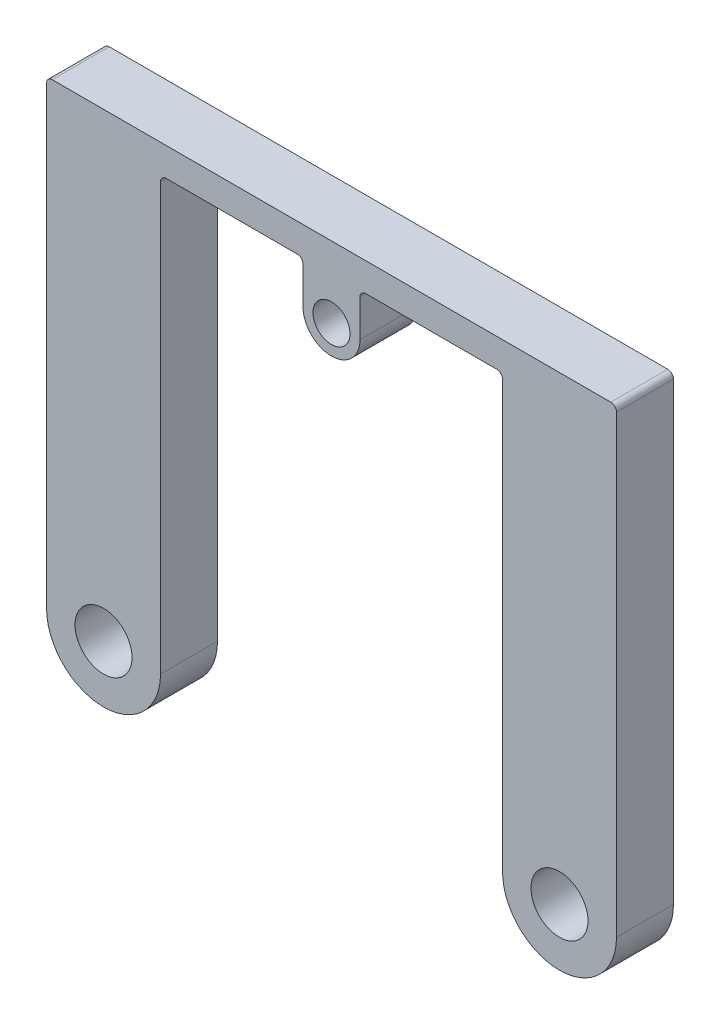
ISO-10303-21;
HEADER;
FILE_DESCRIPTION(('STEP AP214'),'2;1');
FILE_NAME('part.step','',(''),(''),'','','');
FILE_SCHEMA(('AUTOMOTIVE_DESIGN { 1 0 10303 214 1 1 1 1 }'));
ENDSEC;
DATA;
#1=APPLICATION_CONTEXT('core data for automotive mechanical design processes');
#2=APPLICATION_PROTOCOL_DEFINITION('international standard','automotive_design',2000,#1);
#3=PRODUCT_CONTEXT('',#1,'mechanical');
#4=PRODUCT('Part','Part','',(#3));
#5=PRODUCT_RELATED_PRODUCT_CATEGORY('part','',(#4));
#6=PRODUCT_DEFINITION_FORMATION('','',#4);
#7=PRODUCT_DEFINITION_CONTEXT('part definition',#1,'design');
#8=PRODUCT_DEFINITION('design','',#6,#7);
#9=PRODUCT_DEFINITION_SHAPE('','',#8);
#10=(LENGTH_UNIT() NAMED_UNIT(*) SI_UNIT(.MILLI.,.METRE.));
#11=(NAMED_UNIT(*) PLANE_ANGLE_UNIT() SI_UNIT($,.RADIAN.));
#12=(NAMED_UNIT(*) SI_UNIT($,.STERADIAN.) SOLID_ANGLE_UNIT());
#13=UNCERTAINTY_MEASURE_WITH_UNIT(LENGTH_MEASURE(1.E-05),#10,'distance_accuracy_value','');
#14=(GEOMETRIC_REPRESENTATION_CONTEXT(3) GLOBAL_UNCERTAINTY_ASSIGNED_CONTEXT((#13)) GLOBAL_UNIT_ASSIGNED_CONTEXT((#10,
#11,#12)) REPRESENTATION_CONTEXT('',''));
#15=CARTESIAN_POINT('',(0.,0.,0.));
#16=DIRECTION('',(0.,0.,1.));
#17=DIRECTION('',(1.,0.,0.));
#18=AXIS2_PLACEMENT_3D('',#15,#16,#17);
#19=CARTESIAN_POINT('',(0.,75.8172307653194,5.));
#20=DIRECTION('',(0.,1.,0.));
#21=DIRECTION('',(0.,0.,1.));
#22=AXIS2_PLACEMENT_3D('',#19,#20,#21);
#23=PLANE('',#22);
#24=DIRECTION('',(1.,0.,0.));
#25=VECTOR('',#24,1.);
#26=CARTESIAN_POINT('',(0.,75.8172307653194,5.));
#27=LINE('',#26,#25);
#28=CARTESIAN_POINT('',(-29.,75.8172307653194,5.));
#29=VERTEX_POINT('',#28);
#30=CARTESIAN_POINT('',(-6.,75.8172307653194,5.));
#31=VERTEX_POINT('',#30);
#32=EDGE_CURVE('E226',#29,#31,#27,.T.);
#33=ORIENTED_EDGE('',*,*,#32,.F.);
#34=DIRECTION('',(0.,0.,-1.));
#35=VECTOR('',#34,1.);
#36=CARTESIAN_POINT('',(-29.,75.8172307653194,5.));
#37=LINE('',#36,#35);
#38=CARTESIAN_POINT('',(-29.,75.8172307653194,-5.));
#39=VERTEX_POINT('',#38);
#40=EDGE_CURVE('E329',#29,#39,#37,.T.);
#41=ORIENTED_EDGE('',*,*,#40,.T.);
#42=DIRECTION('',(1.,0.,0.));
#43=VECTOR('',#42,1.);
#44=CARTESIAN_POINT('',(0.,75.8172307653194,-5.));
#45=LINE('',#44,#43);
#46=CARTESIAN_POINT('',(-6.,75.8172307653194,-5.));
#47=VERTEX_POINT('',#46);
#48=EDGE_CURVE('E261',#39,#47,#45,.T.);
#49=ORIENTED_EDGE('',*,*,#48,.T.);
#50=DIRECTION('',(0.,0.,1.));
#51=VECTOR('',#50,1.);
#52=CARTESIAN_POINT('',(-6.,75.8172307653194,5.));
#53=LINE('',#52,#51);
#54=EDGE_CURVE('E325',#47,#31,#53,.T.);
#55=ORIENTED_EDGE('',*,*,#54,.T.);
#56=EDGE_LOOP('',(#33,#41,#49,#55));
#57=FACE_BOUND('',#56,.T.);
#58=ADVANCED_FACE('F44',(#57),#23,.F.);
#59=CARTESIAN_POINT('',(-50.,0.,5.));
#60=DIRECTION('',(-1.,0.,0.));
#61=DIRECTION('',(0.,0.,1.));
#62=AXIS2_PLACEMENT_3D('',#59,#60,#61);
#63=PLANE('',#62);
#64=DIRECTION('',(0.,1.,0.));
#65=VECTOR('',#64,1.);
#66=CARTESIAN_POINT('',(-50.,0.,5.));
#67=LINE('',#66,#65);
#68=CARTESIAN_POINT('',(-50.,0.,5.));
#69=VERTEX_POINT('',#68);
#70=CARTESIAN_POINT('',(-50.,79.8172307653194,5.));
#71=VERTEX_POINT('',#70);
#72=EDGE_CURVE('E211',#69,#71,#67,.T.);
#73=ORIENTED_EDGE('',*,*,#72,.T.);
#74=DIRECTION('',(0.,0.,-1.));
#75=VECTOR('',#74,1.);
#76=CARTESIAN_POINT('',(-50.,79.8172307653194,5.));
#77=LINE('',#76,#75);
#78=CARTESIAN_POINT('',(-50.,79.8172307653194,-5.));
#79=VERTEX_POINT('',#78);
#80=EDGE_CURVE('E300',#71,#79,#77,.T.);
#81=ORIENTED_EDGE('',*,*,#80,.T.);
#82=DIRECTION('',(0.,1.,0.));
#83=VECTOR('',#82,1.);
#84=CARTESIAN_POINT('',(-50.,0.,-5.));
#85=LINE('',#84,#83);
#86=CARTESIAN_POINT('',(-50.,0.,-5.));
#87=VERTEX_POINT('',#86);
#88=EDGE_CURVE('E250',#87,#79,#85,.T.);
#89=ORIENTED_EDGE('',*,*,#88,.F.);
#90=DIRECTION('',(0.,0.,-1.));
#91=VECTOR('',#90,1.);
#92=CARTESIAN_POINT('',(-50.,0.,5.));
#93=LINE('',#92,#91);
#94=EDGE_CURVE('E297',#69,#87,#93,.T.);
#95=ORIENTED_EDGE('',*,*,#94,.F.);
#96=EDGE_LOOP('',(#73,#81,#89,#95));
#97=FACE_BOUND('',#96,.T.);
#98=ADVANCED_FACE('F408',(#97),#63,.T.);
#99=CARTESIAN_POINT('',(-40.,0.,5.));
#100=DIRECTION('',(0.,0.,-1.));
#101=DIRECTION('',(-1.,0.,0.));
#102=AXIS2_PLACEMENT_3D('',#99,#100,#101);
#103=CYLINDRICAL_SURFACE('',#102,10.);
#104=CARTESIAN_POINT('',(-40.,0.,-5.));
#105=DIRECTION('',(0.,0.,1.));
#106=DIRECTION('',(1.,0.,0.));
#107=AXIS2_PLACEMENT_3D('',#104,#105,#106);
#108=CIRCLE('',#107,10.);
#109=CARTESIAN_POINT('',(-30.,0.,-5.));
#110=VERTEX_POINT('',#109);
#111=EDGE_CURVE('E253',#87,#110,#108,.T.);
#112=ORIENTED_EDGE('',*,*,#111,.T.);
#113=DIRECTION('',(0.,0.,-1.));
#114=VECTOR('',#113,1.);
#115=CARTESIAN_POINT('',(-30.,0.,5.));
#116=LINE('',#115,#114);
#117=CARTESIAN_POINT('',(-30.,0.,5.));
#118=VERTEX_POINT('',#117);
#119=EDGE_CURVE('E293',#118,#110,#116,.T.);
#120=ORIENTED_EDGE('',*,*,#119,.F.);
#121=CARTESIAN_POINT('',(-40.,0.,5.));
#122=DIRECTION('',(0.,0.,1.));
#123=DIRECTION('',(1.,0.,0.));
#124=AXIS2_PLACEMENT_3D('',#121,#122,#123);
#125=CIRCLE('',#124,10.);
#126=EDGE_CURVE('E215',#69,#118,#125,.T.);
#127=ORIENTED_EDGE('',*,*,#126,.F.);
#128=ORIENTED_EDGE('',*,*,#94,.T.);
#129=EDGE_LOOP('',(#112,#120,#127,#128));
#130=FACE_BOUND('',#129,.T.);
#131=ADVANCED_FACE('F415',(#130),#103,.T.);
#132=CARTESIAN_POINT('',(-30.,0.,5.));
#133=DIRECTION('',(1.,0.,0.));
#134=DIRECTION('',(0.,0.,-1.));
#135=AXIS2_PLACEMENT_3D('',#132,#133,#134);
#136=PLANE('',#135);
#137=DIRECTION('',(0.,-1.,0.));
#138=VECTOR('',#137,1.);
#139=CARTESIAN_POINT('',(-30.,0.,-5.));
#140=LINE('',#139,#138);
#141=CARTESIAN_POINT('',(-30.,74.8172307653194,-5.));
#142=VERTEX_POINT('',#141);
#143=EDGE_CURVE('E257',#142,#110,#140,.T.);
#144=ORIENTED_EDGE('',*,*,#143,.F.);
#145=DIRECTION('',(0.,0.,-1.));
#146=VECTOR('',#145,1.);
#147=CARTESIAN_POINT('',(-30.,74.8172307653194,5.));
#148=LINE('',#147,#146);
#149=CARTESIAN_POINT('',(-30.,74.8172307653194,5.));
#150=VERTEX_POINT('',#149);
#151=EDGE_CURVE('E333',#142,#150,#148,.F.);
#152=ORIENTED_EDGE('',*,*,#151,.T.);
#153=DIRECTION('',(0.,-1.,0.));
#154=VECTOR('',#153,1.);
#155=CARTESIAN_POINT('',(-30.,0.,5.));
#156=LINE('',#155,#154);
#157=EDGE_CURVE('E220',#150,#118,#156,.T.);
#158=ORIENTED_EDGE('',*,*,#157,.T.);
#159=ORIENTED_EDGE('',*,*,#119,.T.);
#160=EDGE_LOOP('',(#144,#152,#158,#159));
#161=FACE_BOUND('',#160,.T.);
#162=ADVANCED_FACE('F418',(#161),#136,.T.);
#163=CARTESIAN_POINT('',(6.,75.8172307653194,5.));
#164=VERTEX_POINT('',#163);
#165=CARTESIAN_POINT('',(29.,75.8172307653194,5.));
#166=VERTEX_POINT('',#165);
#167=EDGE_CURVE('E223',#164,#166,#27,.T.);
#168=ORIENTED_EDGE('',*,*,#167,.F.);
#169=DIRECTION('',(0.,0.,1.));
#170=VECTOR('',#169,1.);
#171=CARTESIAN_POINT('',(6.,75.8172307653194,5.));
#172=LINE('',#171,#170);
#173=CARTESIAN_POINT('',(6.,75.8172307653194,-5.));
#174=VERTEX_POINT('',#173);
#175=EDGE_CURVE('E345',#164,#174,#172,.F.);
#176=ORIENTED_EDGE('',*,*,#175,.T.);
#177=CARTESIAN_POINT('',(29.,75.8172307653194,-5.));
#178=VERTEX_POINT('',#177);
#179=EDGE_CURVE('E260',#174,#178,#45,.T.);
#180=ORIENTED_EDGE('',*,*,#179,.T.);
#181=DIRECTION('',(0.,0.,-1.));
#182=VECTOR('',#181,1.);
#183=CARTESIAN_POINT('',(29.,75.8172307653194,5.));
#184=LINE('',#183,#182);
#185=EDGE_CURVE('E342',#178,#166,#184,.F.);
#186=ORIENTED_EDGE('',*,*,#185,.T.);
#187=EDGE_LOOP('',(#168,#176,#180,#186));
#188=FACE_BOUND('',#187,.T.);
#189=ADVANCED_FACE('F379',(#188),#23,.F.);
#190=CARTESIAN_POINT('',(30.,0.,5.));
#191=DIRECTION('',(-1.,0.,0.));
#192=DIRECTION('',(0.,0.,1.));
#193=AXIS2_PLACEMENT_3D('',#190,#191,#192);
#194=PLANE('',#193);
#195=DIRECTION('',(0.,1.,0.));
#196=VECTOR('',#195,1.);
#197=CARTESIAN_POINT('',(30.,0.,5.));
#198=LINE('',#197,#196);
#199=CARTESIAN_POINT('',(30.,0.,5.));
#200=VERTEX_POINT('',#199);
#201=CARTESIAN_POINT('',(30.,74.8172307653194,5.));
#202=VERTEX_POINT('',#201);
#203=EDGE_CURVE('E227',#200,#202,#198,.T.);
#204=ORIENTED_EDGE('',*,*,#203,.T.);
#205=DIRECTION('',(0.,0.,-1.));
#206=VECTOR('',#205,1.);
#207=CARTESIAN_POINT('',(30.,74.8172307653194,5.));
#208=LINE('',#207,#206);
#209=CARTESIAN_POINT('',(30.,74.8172307653194,-5.));
#210=VERTEX_POINT('',#209);
#211=EDGE_CURVE('E348',#202,#210,#208,.T.);
#212=ORIENTED_EDGE('',*,*,#211,.T.);
#213=DIRECTION('',(0.,1.,0.));
#214=VECTOR('',#213,1.);
#215=CARTESIAN_POINT('',(30.,0.,-5.));
#216=LINE('',#215,#214);
#217=CARTESIAN_POINT('',(30.,0.,-5.));
#218=VERTEX_POINT('',#217);
#219=EDGE_CURVE('E265',#218,#210,#216,.T.);
#220=ORIENTED_EDGE('',*,*,#219,.F.);
#221=DIRECTION('',(0.,0.,-1.));
#222=VECTOR('',#221,1.);
#223=CARTESIAN_POINT('',(30.,0.,5.));
#224=LINE('',#223,#222);
#225=EDGE_CURVE('E290',#200,#218,#224,.T.);
#226=ORIENTED_EDGE('',*,*,#225,.F.);
#227=EDGE_LOOP('',(#204,#212,#220,#226));
#228=FACE_BOUND('',#227,.T.);
#229=ADVANCED_FACE('F383',(#228),#194,.T.);
#230=CARTESIAN_POINT('',(40.,0.,5.));
#231=DIRECTION('',(0.,0.,-1.));
#232=DIRECTION('',(-1.,0.,0.));
#233=AXIS2_PLACEMENT_3D('',#230,#231,#232);
#234=CYLINDRICAL_SURFACE('',#233,10.);
#235=CARTESIAN_POINT('',(40.,0.,-5.));
#236=DIRECTION('',(0.,0.,1.));
#237=DIRECTION('',(1.,0.,0.));
#238=AXIS2_PLACEMENT_3D('',#235,#236,#237);
#239=CIRCLE('',#238,10.);
#240=CARTESIAN_POINT('',(50.,0.,-5.));
#241=VERTEX_POINT('',#240);
#242=EDGE_CURVE('E269',#241,#218,#239,.F.);
#243=ORIENTED_EDGE('',*,*,#242,.F.);
#244=DIRECTION('',(0.,0.,-1.));
#245=VECTOR('',#244,1.);
#246=CARTESIAN_POINT('',(50.,0.,5.));
#247=LINE('',#246,#245);
#248=CARTESIAN_POINT('',(50.,0.,5.));
#249=VERTEX_POINT('',#248);
#250=EDGE_CURVE('E249',#249,#241,#247,.T.);
#251=ORIENTED_EDGE('',*,*,#250,.F.);
#252=CARTESIAN_POINT('',(40.,0.,5.));
#253=DIRECTION('',(0.,0.,1.));
#254=DIRECTION('',(1.,0.,0.));
#255=AXIS2_PLACEMENT_3D('',#252,#253,#254);
#256=CIRCLE('',#255,10.);
#257=EDGE_CURVE('E230',#249,#200,#256,.F.);
#258=ORIENTED_EDGE('',*,*,#257,.T.);
#259=ORIENTED_EDGE('',*,*,#225,.T.);
#260=EDGE_LOOP('',(#243,#251,#258,#259));
#261=FACE_BOUND('',#260,.T.);
#262=ADVANCED_FACE('F391',(#261),#234,.T.);
#263=CARTESIAN_POINT('',(50.,0.,5.));
#264=DIRECTION('',(1.,0.,0.));
#265=DIRECTION('',(0.,0.,-1.));
#266=AXIS2_PLACEMENT_3D('',#263,#264,#265);
#267=PLANE('',#266);
#268=DIRECTION('',(0.,-1.,0.));
#269=VECTOR('',#268,1.);
#270=CARTESIAN_POINT('',(50.,0.,-5.));
#271=LINE('',#270,#269);
#272=CARTESIAN_POINT('',(50.,79.8172307653194,-5.));
#273=VERTEX_POINT('',#272);
#274=EDGE_CURVE('E273',#273,#241,#271,.T.);
#275=ORIENTED_EDGE('',*,*,#274,.F.);
#276=DIRECTION('',(0.,0.,-1.));
#277=VECTOR('',#276,1.);
#278=CARTESIAN_POINT('',(50.,79.8172307653194,5.));
#279=LINE('',#278,#277);
#280=CARTESIAN_POINT('',(50.,79.8172307653194,5.));
#281=VERTEX_POINT('',#280);
#282=EDGE_CURVE('E60',#273,#281,#279,.F.);
#283=ORIENTED_EDGE('',*,*,#282,.T.);
#284=DIRECTION('',(0.,-1.,0.));
#285=VECTOR('',#284,1.);
#286=CARTESIAN_POINT('',(50.,0.,5.));
#287=LINE('',#286,#285);
#288=EDGE_CURVE('E234',#281,#249,#287,.T.);
#289=ORIENTED_EDGE('',*,*,#288,.T.);
#290=ORIENTED_EDGE('',*,*,#250,.T.);
#291=EDGE_LOOP('',(#275,#283,#289,#290));
#292=FACE_BOUND('',#291,.T.);
#293=ADVANCED_FACE('F392',(#292),#267,.T.);
#294=CARTESIAN_POINT('',(-40.,0.,5.));
#295=DIRECTION('',(0.,0.,-1.));
#296=DIRECTION('',(-1.,0.,0.));
#297=AXIS2_PLACEMENT_3D('',#294,#295,#296);
#298=CYLINDRICAL_SURFACE('',#297,5.);
#299=CARTESIAN_POINT('',(-40.,0.,5.));
#300=DIRECTION('',(0.,0.,1.));
#301=DIRECTION('',(1.,0.,0.));
#302=AXIS2_PLACEMENT_3D('',#299,#300,#301);
#303=CIRCLE('',#302,5.);
#304=CARTESIAN_POINT('',(-35.,0.,5.));
#305=VERTEX_POINT('',#304);
#306=EDGE_CURVE('E241',#305,#305,#303,.T.);
#307=ORIENTED_EDGE('',*,*,#306,.T.);
#308=EDGE_LOOP('',(#307));
#309=FACE_BOUND('',#308,.T.);
#310=CARTESIAN_POINT('',(-40.,0.,-5.));
#311=DIRECTION('',(0.,0.,1.));
#312=DIRECTION('',(1.,0.,0.));
#313=AXIS2_PLACEMENT_3D('',#310,#311,#312);
#314=CIRCLE('',#313,5.);
#315=CARTESIAN_POINT('',(-35.,0.,-5.));
#316=VERTEX_POINT('',#315);
#317=EDGE_CURVE('E280',#316,#316,#314,.T.);
#318=ORIENTED_EDGE('',*,*,#317,.F.);
#319=EDGE_LOOP('',(#318));
#320=FACE_BOUND('',#319,.T.);
#321=ADVANCED_FACE('F611',(#309,#320),#298,.F.);
#322=CARTESIAN_POINT('',(0.,80.8172307653194,5.));
#323=DIRECTION('',(0.,1.,0.));
#324=DIRECTION('',(0.,0.,1.));
#325=AXIS2_PLACEMENT_3D('',#322,#323,#324);
#326=PLANE('',#325);
#327=DIRECTION('',(1.,0.,0.));
#328=VECTOR('',#327,1.);
#329=CARTESIAN_POINT('',(0.,80.8172307653194,-5.));
#330=LINE('',#329,#328);
#331=CARTESIAN_POINT('',(-49.,80.8172307653194,-5.));
#332=VERTEX_POINT('',#331);
#333=CARTESIAN_POINT('',(49.,80.8172307653194,-5.));
#334=VERTEX_POINT('',#333);
#335=EDGE_CURVE('E276',#332,#334,#330,.T.);
#336=ORIENTED_EDGE('',*,*,#335,.F.);
#337=DIRECTION('',(0.,0.,-1.));
#338=VECTOR('',#337,1.);
#339=CARTESIAN_POINT('',(-49.,80.8172307653194,5.));
#340=LINE('',#339,#338);
#341=CARTESIAN_POINT('',(-49.,80.8172307653194,5.));
#342=VERTEX_POINT('',#341);
#343=EDGE_CURVE('E314',#332,#342,#340,.F.);
#344=ORIENTED_EDGE('',*,*,#343,.T.);
#345=DIRECTION('',(1.,0.,0.));
#346=VECTOR('',#345,1.);
#347=CARTESIAN_POINT('',(0.,80.8172307653194,5.));
#348=LINE('',#347,#346);
#349=CARTESIAN_POINT('',(49.,80.8172307653194,5.));
#350=VERTEX_POINT('',#349);
#351=EDGE_CURVE('E237',#342,#350,#348,.T.);
#352=ORIENTED_EDGE('',*,*,#351,.T.);
#353=DIRECTION('',(0.,0.,-1.));
#354=VECTOR('',#353,1.);
#355=CARTESIAN_POINT('',(49.,80.8172307653194,5.));
#356=LINE('',#355,#354);
#357=EDGE_CURVE('E310',#350,#334,#356,.T.);
#358=ORIENTED_EDGE('',*,*,#357,.T.);
#359=EDGE_LOOP('',(#336,#344,#352,#358));
#360=FACE_BOUND('',#359,.T.);
#361=ADVANCED_FACE('F399',(#360),#326,.T.);
#362=CARTESIAN_POINT('',(40.,0.,5.));
#363=DIRECTION('',(0.,0.,-1.));
#364=DIRECTION('',(-1.,0.,0.));
#365=AXIS2_PLACEMENT_3D('',#362,#363,#364);
#366=CYLINDRICAL_SURFACE('',#365,5.);
#367=CARTESIAN_POINT('',(40.,0.,5.));
#368=DIRECTION('',(0.,0.,1.));
#369=DIRECTION('',(1.,0.,0.));
#370=AXIS2_PLACEMENT_3D('',#367,#368,#369);
#371=CIRCLE('',#370,5.);
#372=CARTESIAN_POINT('',(45.,0.,5.));
#373=VERTEX_POINT('',#372);
#374=EDGE_CURVE('E245',#373,#373,#371,.F.);
#375=ORIENTED_EDGE('',*,*,#374,.F.);
#376=EDGE_LOOP('',(#375));
#377=FACE_BOUND('',#376,.T.);
#378=CARTESIAN_POINT('',(40.,0.,-5.));
#379=DIRECTION('',(0.,0.,1.));
#380=DIRECTION('',(1.,0.,0.));
#381=AXIS2_PLACEMENT_3D('',#378,#379,#380);
#382=CIRCLE('',#381,5.);
#383=CARTESIAN_POINT('',(45.,0.,-5.));
#384=VERTEX_POINT('',#383);
#385=EDGE_CURVE('E216',#384,#384,#382,.F.);
#386=ORIENTED_EDGE('',*,*,#385,.T.);
#387=EDGE_LOOP('',(#386));
#388=FACE_BOUND('',#387,.T.);
#389=ADVANCED_FACE('F454',(#377,#388),#366,.F.);
#390=CARTESIAN_POINT('',(0.,0.,5.));
#391=DIRECTION('',(0.,0.,1.));
#392=DIRECTION('',(1.,0.,0.));
#393=AXIS2_PLACEMENT_3D('',#390,#391,#392);
#394=PLANE('',#393);
#395=ORIENTED_EDGE('',*,*,#351,.F.);
#396=CARTESIAN_POINT('',(-49.,79.8172307653194,5.));
#397=DIRECTION('',(0.,0.,1.));
#398=DIRECTION('',(1.,0.,0.));
#399=AXIS2_PLACEMENT_3D('',#396,#397,#398);
#400=CIRCLE('',#399,1.);
#401=EDGE_CURVE('E320',#342,#71,#400,.T.);
#402=ORIENTED_EDGE('',*,*,#401,.T.);
#403=ORIENTED_EDGE('',*,*,#72,.F.);
#404=ORIENTED_EDGE('',*,*,#126,.T.);
#405=ORIENTED_EDGE('',*,*,#157,.F.);
#406=CARTESIAN_POINT('',(-29.,74.8172307653194,5.));
#407=DIRECTION('',(0.,0.,1.));
#408=DIRECTION('',(1.,0.,0.));
#409=AXIS2_PLACEMENT_3D('',#406,#407,#408);
#410=CIRCLE('',#409,1.);
#411=EDGE_CURVE('E355',#150,#29,#410,.F.);
#412=ORIENTED_EDGE('',*,*,#411,.T.);
#413=ORIENTED_EDGE('',*,*,#32,.T.);
#414=CARTESIAN_POINT('',(-6.,74.8172307653194,5.));
#415=DIRECTION('',(0.,0.,1.));
#416=DIRECTION('',(1.,0.,0.));
#417=AXIS2_PLACEMENT_3D('',#414,#415,#416);
#418=CIRCLE('',#417,1.);
#419=CARTESIAN_POINT('',(-5.,74.8172307653194,5.));
#420=VERTEX_POINT('',#419);
#421=EDGE_CURVE('E358',#31,#420,#418,.F.);
#422=ORIENTED_EDGE('',*,*,#421,.T.);
#423=DIRECTION('',(0.,1.,0.));
#424=VECTOR('',#423,1.);
#425=CARTESIAN_POINT('',(-4.99999999999998,0.,5.));
#426=LINE('',#425,#424);
#427=CARTESIAN_POINT('',(-5.,68.3172307653194,5.));
#428=VERTEX_POINT('',#427);
#429=EDGE_CURVE('E201',#428,#420,#426,.T.);
#430=ORIENTED_EDGE('',*,*,#429,.F.);
#431=CARTESIAN_POINT('',(0.,68.3172307653194,5.));
#432=DIRECTION('',(0.,0.,1.));
#433=DIRECTION('',(1.,0.,0.));
#434=AXIS2_PLACEMENT_3D('',#431,#432,#433);
#435=CIRCLE('',#434,5.00000000000001);
#436=CARTESIAN_POINT('',(5.,68.3172307653194,5.));
#437=VERTEX_POINT('',#436);
#438=EDGE_CURVE('E199',#428,#437,#435,.T.);
#439=ORIENTED_EDGE('',*,*,#438,.T.);
#440=DIRECTION('',(0.,1.,0.));
#441=VECTOR('',#440,1.);
#442=CARTESIAN_POINT('',(4.99999999999998,0.,5.));
#443=LINE('',#442,#441);
#444=CARTESIAN_POINT('',(5.,74.8172307653194,5.));
#445=VERTEX_POINT('',#444);
#446=EDGE_CURVE('E194',#437,#445,#443,.T.);
#447=ORIENTED_EDGE('',*,*,#446,.T.);
#448=CARTESIAN_POINT('',(6.,74.8172307653194,5.));
#449=DIRECTION('',(0.,0.,1.));
#450=DIRECTION('',(1.,0.,0.));
#451=AXIS2_PLACEMENT_3D('',#448,#449,#450);
#452=CIRCLE('',#451,1.);
#453=EDGE_CURVE('E364',#445,#164,#452,.F.);
#454=ORIENTED_EDGE('',*,*,#453,.T.);
#455=ORIENTED_EDGE('',*,*,#167,.T.);
#456=CARTESIAN_POINT('',(29.,74.8172307653194,5.));
#457=DIRECTION('',(0.,0.,1.));
#458=DIRECTION('',(1.,0.,0.));
#459=AXIS2_PLACEMENT_3D('',#456,#457,#458);
#460=CIRCLE('',#459,1.);
#461=EDGE_CURVE('E11',#166,#202,#460,.F.);
#462=ORIENTED_EDGE('',*,*,#461,.T.);
#463=ORIENTED_EDGE('',*,*,#203,.F.);
#464=ORIENTED_EDGE('',*,*,#257,.F.);
#465=ORIENTED_EDGE('',*,*,#288,.F.);
#466=CARTESIAN_POINT('',(49.,79.8172307653194,5.));
#467=DIRECTION('',(0.,0.,1.));
#468=DIRECTION('',(1.,0.,0.));
#469=AXIS2_PLACEMENT_3D('',#466,#467,#468);
#470=CIRCLE('',#469,1.);
#471=EDGE_CURVE('E317',#281,#350,#470,.T.);
#472=ORIENTED_EDGE('',*,*,#471,.T.);
#473=EDGE_LOOP('',(#395,#402,#403,#404,#405,#412,#413,#422,#430,#439,#447,#454,#455,#462,#463,
#464,#465,#472));
#474=FACE_BOUND('',#473,.T.);
#475=ORIENTED_EDGE('',*,*,#306,.F.);
#476=EDGE_LOOP('',(#475));
#477=FACE_BOUND('',#476,.T.);
#478=ORIENTED_EDGE('',*,*,#374,.T.);
#479=EDGE_LOOP('',(#478));
#480=FACE_BOUND('',#479,.T.);
#481=CARTESIAN_POINT('',(0.,68.3172307653194,5.));
#482=DIRECTION('',(0.,0.,1.));
#483=DIRECTION('',(1.,0.,0.));
#484=AXIS2_PLACEMENT_3D('',#481,#482,#483);
#485=CIRCLE('',#484,3.25);
#486=CARTESIAN_POINT('',(3.25,68.3172307653194,5.));
#487=VERTEX_POINT('',#486);
#488=EDGE_CURVE('E435',#487,#487,#485,.T.);
#489=ORIENTED_EDGE('',*,*,#488,.F.);
#490=EDGE_LOOP('',(#489));
#491=FACE_BOUND('',#490,.T.);
#492=ADVANCED_FACE('F386',(#474,#477,#480,#491),#394,.T.);
#493=CARTESIAN_POINT('',(0.,0.,-5.));
#494=DIRECTION('',(0.,0.,1.));
#495=DIRECTION('',(1.,0.,0.));
#496=AXIS2_PLACEMENT_3D('',#493,#494,#495);
#497=PLANE('',#496);
#498=ORIENTED_EDGE('',*,*,#88,.T.);
#499=CARTESIAN_POINT('',(-49.,79.8172307653194,-5.));
#500=DIRECTION('',(0.,0.,1.));
#501=DIRECTION('',(1.,0.,0.));
#502=AXIS2_PLACEMENT_3D('',#499,#500,#501);
#503=CIRCLE('',#502,1.);
#504=EDGE_CURVE('E307',#79,#332,#503,.F.);
#505=ORIENTED_EDGE('',*,*,#504,.T.);
#506=ORIENTED_EDGE('',*,*,#335,.T.);
#507=CARTESIAN_POINT('',(49.,79.8172307653194,-5.));
#508=DIRECTION('',(0.,0.,1.));
#509=DIRECTION('',(1.,0.,0.));
#510=AXIS2_PLACEMENT_3D('',#507,#508,#509);
#511=CIRCLE('',#510,1.);
#512=EDGE_CURVE('E304',#334,#273,#511,.F.);
#513=ORIENTED_EDGE('',*,*,#512,.T.);
#514=ORIENTED_EDGE('',*,*,#274,.T.);
#515=ORIENTED_EDGE('',*,*,#242,.T.);
#516=ORIENTED_EDGE('',*,*,#219,.T.);
#517=CARTESIAN_POINT('',(29.,74.8172307653194,-5.));
#518=DIRECTION('',(0.,0.,1.));
#519=DIRECTION('',(1.,0.,0.));
#520=AXIS2_PLACEMENT_3D('',#517,#518,#519);
#521=CIRCLE('',#520,1.);
#522=EDGE_CURVE('E53',#210,#178,#521,.T.);
#523=ORIENTED_EDGE('',*,*,#522,.T.);
#524=ORIENTED_EDGE('',*,*,#179,.F.);
#525=CARTESIAN_POINT('',(6.,74.8172307653194,-5.));
#526=DIRECTION('',(0.,0.,1.));
#527=DIRECTION('',(1.,0.,0.));
#528=AXIS2_PLACEMENT_3D('',#525,#526,#527);
#529=CIRCLE('',#528,1.);
#530=CARTESIAN_POINT('',(5.,74.8172307653194,-5.));
#531=VERTEX_POINT('',#530);
#532=EDGE_CURVE('E367',#174,#531,#529,.T.);
#533=ORIENTED_EDGE('',*,*,#532,.T.);
#534=DIRECTION('',(0.,-1.,0.));
#535=VECTOR('',#534,1.);
#536=CARTESIAN_POINT('',(4.99999999999998,0.,-5.));
#537=LINE('',#536,#535);
#538=CARTESIAN_POINT('',(5.,68.3172307653194,-5.));
#539=VERTEX_POINT('',#538);
#540=EDGE_CURVE('E190',#531,#539,#537,.T.);
#541=ORIENTED_EDGE('',*,*,#540,.T.);
#542=CARTESIAN_POINT('',(0.,68.3172307653194,-5.));
#543=DIRECTION('',(0.,0.,1.));
#544=DIRECTION('',(1.,0.,0.));
#545=AXIS2_PLACEMENT_3D('',#542,#543,#544);
#546=CIRCLE('',#545,5.00000000000001);
#547=CARTESIAN_POINT('',(-5.,68.3172307653194,-5.));
#548=VERTEX_POINT('',#547);
#549=EDGE_CURVE('E185',#539,#548,#546,.F.);
#550=ORIENTED_EDGE('',*,*,#549,.T.);
#551=DIRECTION('',(0.,-1.,0.));
#552=VECTOR('',#551,1.);
#553=CARTESIAN_POINT('',(-4.99999999999998,0.,-5.));
#554=LINE('',#553,#552);
#555=CARTESIAN_POINT('',(-5.,74.8172307653194,-5.));
#556=VERTEX_POINT('',#555);
#557=EDGE_CURVE('E170',#556,#548,#554,.T.);
#558=ORIENTED_EDGE('',*,*,#557,.F.);
#559=CARTESIAN_POINT('',(-6.,74.8172307653194,-5.));
#560=DIRECTION('',(0.,0.,1.));
#561=DIRECTION('',(1.,0.,0.));
#562=AXIS2_PLACEMENT_3D('',#559,#560,#561);
#563=CIRCLE('',#562,1.);
#564=EDGE_CURVE('E361',#556,#47,#563,.T.);
#565=ORIENTED_EDGE('',*,*,#564,.T.);
#566=ORIENTED_EDGE('',*,*,#48,.F.);
#567=CARTESIAN_POINT('',(-29.,74.8172307653194,-5.));
#568=DIRECTION('',(0.,0.,1.));
#569=DIRECTION('',(1.,0.,0.));
#570=AXIS2_PLACEMENT_3D('',#567,#568,#569);
#571=CIRCLE('',#570,1.);
#572=EDGE_CURVE('E352',#39,#142,#571,.T.);
#573=ORIENTED_EDGE('',*,*,#572,.T.);
#574=ORIENTED_EDGE('',*,*,#143,.T.);
#575=ORIENTED_EDGE('',*,*,#111,.F.);
#576=EDGE_LOOP('',(#498,#505,#506,#513,#514,#515,#516,#523,#524,#533,#541,#550,#558,#565,#566,
#573,#574,#575));
#577=FACE_BOUND('',#576,.T.);
#578=ORIENTED_EDGE('',*,*,#317,.T.);
#579=EDGE_LOOP('',(#578));
#580=FACE_BOUND('',#579,.T.);
#581=ORIENTED_EDGE('',*,*,#385,.F.);
#582=EDGE_LOOP('',(#581));
#583=FACE_BOUND('',#582,.T.);
#584=CARTESIAN_POINT('',(0.,68.3172307653194,-5.));
#585=DIRECTION('',(0.,0.,1.));
#586=DIRECTION('',(1.,0.,0.));
#587=AXIS2_PLACEMENT_3D('',#584,#585,#586);
#588=CIRCLE('',#587,3.25);
#589=CARTESIAN_POINT('',(3.25,68.3172307653194,-5.));
#590=VERTEX_POINT('',#589);
#591=EDGE_CURVE('E204',#590,#590,#588,.F.);
#592=ORIENTED_EDGE('',*,*,#591,.F.);
#593=EDGE_LOOP('',(#592));
#594=FACE_BOUND('',#593,.T.);
#595=ADVANCED_FACE('F187',(#577,#580,#583,#594),#497,.F.);
#596=CARTESIAN_POINT('',(0.,68.3172307653194,-21.0078105935821));
#597=DIRECTION('',(0.,0.,1.));
#598=DIRECTION('',(1.,0.,0.));
#599=AXIS2_PLACEMENT_3D('',#596,#597,#598);
#600=CYLINDRICAL_SURFACE('',#599,5.00000000000001);
#601=ORIENTED_EDGE('',*,*,#549,.F.);
#602=DIRECTION('',(0.,0.,1.));
#603=VECTOR('',#602,1.);
#604=CARTESIAN_POINT('',(5.,68.3172307653194,-21.0078105935821));
#605=LINE('',#604,#603);
#606=EDGE_CURVE('E182',#539,#437,#605,.T.);
#607=ORIENTED_EDGE('',*,*,#606,.T.);
#608=ORIENTED_EDGE('',*,*,#438,.F.);
#609=DIRECTION('',(0.,0.,1.));
#610=VECTOR('',#609,1.);
#611=CARTESIAN_POINT('',(-5.,68.3172307653194,-21.0078105935821));
#612=LINE('',#611,#610);
#613=EDGE_CURVE('E175',#548,#428,#612,.T.);
#614=ORIENTED_EDGE('',*,*,#613,.F.);
#615=EDGE_LOOP('',(#601,#607,#608,#614));
#616=FACE_BOUND('',#615,.T.);
#617=ADVANCED_FACE('F197',(#616),#600,.T.);
#618=CARTESIAN_POINT('',(-4.99999999999998,0.,-21.0078105935821));
#619=DIRECTION('',(1.,0.,0.));
#620=DIRECTION('',(0.,1.,0.));
#621=AXIS2_PLACEMENT_3D('',#618,#619,#620);
#622=PLANE('',#621);
#623=ORIENTED_EDGE('',*,*,#429,.T.);
#624=DIRECTION('',(0.,0.,1.));
#625=VECTOR('',#624,1.);
#626=CARTESIAN_POINT('',(-5.,74.8172307653194,-5.));
#627=LINE('',#626,#625);
#628=EDGE_CURVE('E178',#420,#556,#627,.F.);
#629=ORIENTED_EDGE('',*,*,#628,.T.);
#630=ORIENTED_EDGE('',*,*,#557,.T.);
#631=ORIENTED_EDGE('',*,*,#613,.T.);
#632=EDGE_LOOP('',(#623,#629,#630,#631));
#633=FACE_BOUND('',#632,.T.);
#634=ADVANCED_FACE('F173',(#633),#622,.F.);
#635=CARTESIAN_POINT('',(0.,68.3172307653194,-21.0078105935821));
#636=DIRECTION('',(0.,0.,1.));
#637=DIRECTION('',(1.,0.,0.));
#638=AXIS2_PLACEMENT_3D('',#635,#636,#637);
#639=CYLINDRICAL_SURFACE('',#638,3.25);
#640=CARTESIAN_POINT('',(3.25,68.3172307653194,-5.));
#641=CARTESIAN_POINT('',(3.25,68.3172307653194,-4.89583333333334));
#642=CARTESIAN_POINT('',(3.25,68.3172307653194,-4.79166666666667));
#643=CARTESIAN_POINT('',(3.25,68.3172307653194,-4.58333333333334));
#644=CARTESIAN_POINT('',(3.25,68.3172307653194,-4.47916666666667));
#645=CARTESIAN_POINT('',(3.25,68.3172307653194,-4.27083333333334));
#646=CARTESIAN_POINT('',(3.25,68.3172307653194,-4.16666666666667));
#647=CARTESIAN_POINT('',(3.25,68.3172307653194,-3.95833333333334));
#648=CARTESIAN_POINT('',(3.25,68.3172307653194,-3.85416666666667));
#649=CARTESIAN_POINT('',(3.25,68.3172307653194,-3.64583333333334));
#650=CARTESIAN_POINT('',(3.25,68.3172307653194,-3.54166666666667));
#651=CARTESIAN_POINT('',(3.25,68.3172307653194,-3.33333333333334));
#652=CARTESIAN_POINT('',(3.25,68.3172307653194,-3.22916666666667));
#653=CARTESIAN_POINT('',(3.25,68.3172307653194,-3.02083333333334));
#654=CARTESIAN_POINT('',(3.25,68.3172307653194,-2.91666666666667));
#655=CARTESIAN_POINT('',(3.25,68.3172307653194,-2.70833333333334));
#656=CARTESIAN_POINT('',(3.25,68.3172307653194,-2.60416666666667));
#657=CARTESIAN_POINT('',(3.25,68.3172307653194,-2.39583333333334));
#658=CARTESIAN_POINT('',(3.25,68.3172307653194,-2.29166666666667));
#659=CARTESIAN_POINT('',(3.25,68.3172307653194,-2.08333333333334));
#660=CARTESIAN_POINT('',(3.25,68.3172307653194,-1.97916666666667));
#661=CARTESIAN_POINT('',(3.25,68.3172307653194,-1.77083333333334));
#662=CARTESIAN_POINT('',(3.25,68.3172307653194,-1.66666666666667));
#663=CARTESIAN_POINT('',(3.25,68.3172307653194,-1.45833333333334));
#664=CARTESIAN_POINT('',(3.25,68.3172307653194,-1.35416666666667));
#665=CARTESIAN_POINT('',(3.25,68.3172307653194,-1.14583333333334));
#666=CARTESIAN_POINT('',(3.25,68.3172307653194,-1.04166666666667));
#667=CARTESIAN_POINT('',(3.25,68.3172307653194,-0.833333333333338));
#668=CARTESIAN_POINT('',(3.25,68.3172307653194,-0.729166666666671));
#669=CARTESIAN_POINT('',(3.25,68.3172307653194,-0.520833333333337));
#670=CARTESIAN_POINT('',(3.25,68.3172307653194,-0.416666666666671));
#671=CARTESIAN_POINT('',(3.25,68.3172307653194,-0.208333333333337));
#672=CARTESIAN_POINT('',(3.25,68.3172307653194,-0.10416666666667));
#673=CARTESIAN_POINT('',(3.25,68.3172307653194,0.104166666666663));
#674=CARTESIAN_POINT('',(3.25,68.3172307653194,0.20833333333333));
#675=CARTESIAN_POINT('',(3.25,68.3172307653194,0.416666666666664));
#676=CARTESIAN_POINT('',(3.25,68.3172307653194,0.52083333333333));
#677=CARTESIAN_POINT('',(3.25,68.3172307653194,0.729166666666664));
#678=CARTESIAN_POINT('',(3.25,68.3172307653194,0.833333333333331));
#679=CARTESIAN_POINT('',(3.25,68.3172307653194,1.04166666666666));
#680=CARTESIAN_POINT('',(3.25,68.3172307653194,1.14583333333333));
#681=CARTESIAN_POINT('',(3.25,68.3172307653194,1.35416666666666));
#682=CARTESIAN_POINT('',(3.25,68.3172307653194,1.45833333333333));
#683=CARTESIAN_POINT('',(3.25,68.3172307653194,1.66666666666666));
#684=CARTESIAN_POINT('',(3.25,68.3172307653194,1.77083333333333));
#685=CARTESIAN_POINT('',(3.25,68.3172307653194,1.97916666666666));
#686=CARTESIAN_POINT('',(3.25,68.3172307653194,2.08333333333333));
#687=CARTESIAN_POINT('',(3.25,68.3172307653194,2.29166666666666));
#688=CARTESIAN_POINT('',(3.25,68.3172307653194,2.39583333333333));
#689=CARTESIAN_POINT('',(3.25,68.3172307653194,2.60416666666666));
#690=CARTESIAN_POINT('',(3.25,68.3172307653194,2.70833333333333));
#691=CARTESIAN_POINT('',(3.25,68.3172307653194,2.91666666666666));
#692=CARTESIAN_POINT('',(3.25,68.3172307653194,3.02083333333333));
#693=CARTESIAN_POINT('',(3.25,68.3172307653194,3.22916666666666));
#694=CARTESIAN_POINT('',(3.25,68.3172307653194,3.33333333333333));
#695=CARTESIAN_POINT('',(3.25,68.3172307653194,3.54166666666666));
#696=CARTESIAN_POINT('',(3.25,68.3172307653194,3.64583333333333));
#697=CARTESIAN_POINT('',(3.25,68.3172307653194,3.85416666666666));
#698=CARTESIAN_POINT('',(3.25,68.3172307653194,3.95833333333333));
#699=CARTESIAN_POINT('',(3.25,68.3172307653194,4.16666666666666));
#700=CARTESIAN_POINT('',(3.25,68.3172307653194,4.27083333333333));
#701=CARTESIAN_POINT('',(3.25,68.3172307653194,4.47916666666666));
#702=CARTESIAN_POINT('',(3.25,68.3172307653194,4.58333333333333));
#703=CARTESIAN_POINT('',(3.25,68.3172307653194,4.79166666666666));
#704=CARTESIAN_POINT('',(3.25,68.3172307653194,4.89583333333333));
#705=CARTESIAN_POINT('',(3.25,68.3172307653194,5.));
#706=B_SPLINE_CURVE_WITH_KNOTS('',3,(#640,#641,#642,#643,#644,#645,#646,#647,#648,#649,#650,
#651,#652,#653,#654,#655,#656,#657,#658,#659,#660,#661,#662,#663,#664,#665,#666,#667,#668,#669,
#670,#671,#672,#673,#674,#675,#676,#677,#678,#679,#680,#681,#682,#683,#684,#685,#686,#687,#688,
#689,#690,#691,#692,#693,#694,#695,#696,#697,#698,#699,#700,#701,#702,#703,#704,#705),
.UNSPECIFIED.,.F.,.F.,(4,2,2,2,2,2,2,2,2,2,2,2,2,2,2,2,2,2,2,2,2,2,2,2,2,2,2,2,2,2,2,2,4),(0.,
0.3125,0.625000000000001,0.937500000000001,1.25,1.5625,1.875,2.1875,2.5,2.8125,3.125,3.4375,
3.75,4.0625,4.375,4.6875,5.,5.3125,5.625,5.9375,6.25,6.5625,6.875,7.1875,7.5,7.8125,8.125,
8.4375,8.75,9.0625,9.375,9.6875,10.),.UNSPECIFIED.);
#707=EDGE_CURVE('BSEAM443',#590,#487,#706,.T.);
#708=ORIENTED_EDGE('',*,*,#591,.T.);
#709=ORIENTED_EDGE('',*,*,#488,.T.);
#710=ORIENTED_EDGE('',*,*,#707,.T.);
#711=ORIENTED_EDGE('',*,*,#707,.F.);
#712=EDGE_LOOP('',(#708,#710,#709,#711));
#713=FACE_BOUND('',#712,.T.);
#714=ADVANCED_FACE('F443',(#713),#639,.F.);
#715=CARTESIAN_POINT('',(4.99999999999998,0.,-21.0078105935821));
#716=DIRECTION('',(1.,0.,0.));
#717=DIRECTION('',(0.,1.,0.));
#718=AXIS2_PLACEMENT_3D('',#715,#716,#717);
#719=PLANE('',#718);
#720=ORIENTED_EDGE('',*,*,#540,.F.);
#721=DIRECTION('',(0.,0.,1.));
#722=VECTOR('',#721,1.);
#723=CARTESIAN_POINT('',(5.,74.8172307653194,-21.0078105935821));
#724=LINE('',#723,#722);
#725=EDGE_CURVE('E338',#531,#445,#724,.T.);
#726=ORIENTED_EDGE('',*,*,#725,.T.);
#727=ORIENTED_EDGE('',*,*,#446,.F.);
#728=ORIENTED_EDGE('',*,*,#606,.F.);
#729=EDGE_LOOP('',(#720,#726,#727,#728));
#730=FACE_BOUND('',#729,.T.);
#731=ADVANCED_FACE('F478',(#730),#719,.T.);
#732=CARTESIAN_POINT('',(-49.,79.8172307653194,5.));
#733=DIRECTION('',(0.,0.,-1.));
#734=DIRECTION('',(-1.,0.,0.));
#735=AXIS2_PLACEMENT_3D('',#732,#733,#734);
#736=CYLINDRICAL_SURFACE('',#735,1.);
#737=ORIENTED_EDGE('',*,*,#401,.F.);
#738=ORIENTED_EDGE('',*,*,#343,.F.);
#739=ORIENTED_EDGE('',*,*,#504,.F.);
#740=ORIENTED_EDGE('',*,*,#80,.F.);
#741=EDGE_LOOP('',(#737,#738,#739,#740));
#742=FACE_BOUND('',#741,.T.);
#743=ADVANCED_FACE('F406',(#742),#736,.T.);
#744=CARTESIAN_POINT('',(49.,79.8172307653194,5.));
#745=DIRECTION('',(0.,0.,-1.));
#746=DIRECTION('',(-1.,0.,0.));
#747=AXIS2_PLACEMENT_3D('',#744,#745,#746);
#748=CYLINDRICAL_SURFACE('',#747,1.);
#749=ORIENTED_EDGE('',*,*,#471,.F.);
#750=ORIENTED_EDGE('',*,*,#282,.F.);
#751=ORIENTED_EDGE('',*,*,#512,.F.);
#752=ORIENTED_EDGE('',*,*,#357,.F.);
#753=EDGE_LOOP('',(#749,#750,#751,#752));
#754=FACE_BOUND('',#753,.T.);
#755=ADVANCED_FACE('F396',(#754),#748,.T.);
#756=CARTESIAN_POINT('',(-29.,74.8172307653194,5.));
#757=DIRECTION('',(0.,0.,-1.));
#758=DIRECTION('',(-1.,0.,0.));
#759=AXIS2_PLACEMENT_3D('',#756,#757,#758);
#760=CYLINDRICAL_SURFACE('',#759,1.);
#761=ORIENTED_EDGE('',*,*,#411,.F.);
#762=ORIENTED_EDGE('',*,*,#151,.F.);
#763=ORIENTED_EDGE('',*,*,#572,.F.);
#764=ORIENTED_EDGE('',*,*,#40,.F.);
#765=EDGE_LOOP('',(#761,#762,#763,#764));
#766=FACE_BOUND('',#765,.T.);
#767=ADVANCED_FACE('F421',(#766),#760,.F.);
#768=CARTESIAN_POINT('',(-6.,74.8172307653194,5.));
#769=DIRECTION('',(0.,0.,-1.));
#770=DIRECTION('',(-1.,0.,0.));
#771=AXIS2_PLACEMENT_3D('',#768,#769,#770);
#772=CYLINDRICAL_SURFACE('',#771,1.);
#773=ORIENTED_EDGE('',*,*,#564,.F.);
#774=ORIENTED_EDGE('',*,*,#628,.F.);
#775=ORIENTED_EDGE('',*,*,#421,.F.);
#776=ORIENTED_EDGE('',*,*,#54,.F.);
#777=EDGE_LOOP('',(#773,#774,#775,#776));
#778=FACE_BOUND('',#777,.T.);
#779=ADVANCED_FACE('F483',(#778),#772,.F.);
#780=CARTESIAN_POINT('',(6.,74.8172307653194,-21.0078105935821));
#781=DIRECTION('',(0.,0.,1.));
#782=DIRECTION('',(1.,0.,0.));
#783=AXIS2_PLACEMENT_3D('',#780,#781,#782);
#784=CYLINDRICAL_SURFACE('',#783,1.);
#785=ORIENTED_EDGE('',*,*,#532,.F.);
#786=ORIENTED_EDGE('',*,*,#175,.F.);
#787=ORIENTED_EDGE('',*,*,#453,.F.);
#788=ORIENTED_EDGE('',*,*,#725,.F.);
#789=EDGE_LOOP('',(#785,#786,#787,#788));
#790=FACE_BOUND('',#789,.T.);
#791=ADVANCED_FACE('F485',(#790),#784,.F.);
#792=CARTESIAN_POINT('',(29.,74.8172307653194,5.));
#793=DIRECTION('',(0.,0.,-1.));
#794=DIRECTION('',(-1.,0.,0.));
#795=AXIS2_PLACEMENT_3D('',#792,#793,#794);
#796=CYLINDRICAL_SURFACE('',#795,1.);
#797=ORIENTED_EDGE('',*,*,#461,.F.);
#798=ORIENTED_EDGE('',*,*,#185,.F.);
#799=ORIENTED_EDGE('',*,*,#522,.F.);
#800=ORIENTED_EDGE('',*,*,#211,.F.);
#801=EDGE_LOOP('',(#797,#798,#799,#800));
#802=FACE_BOUND('',#801,.T.);
#803=ADVANCED_FACE('F46',(#802),#796,.F.);
#804=CLOSED_SHELL('',(#58,#98,#131,#162,#189,#229,#262,#293,#321,#361,#389,#492,#595,#617,#634,
#714,#731,#743,#755,#767,#779,#791,#803));
#805=MANIFOLD_SOLID_BREP('B2',#804);
#806=ADVANCED_BREP_SHAPE_REPRESENTATION('',(#18,#805),#14);
#807=SHAPE_DEFINITION_REPRESENTATION(#9,#806);
ENDSEC;
END-ISO-10303-21;
